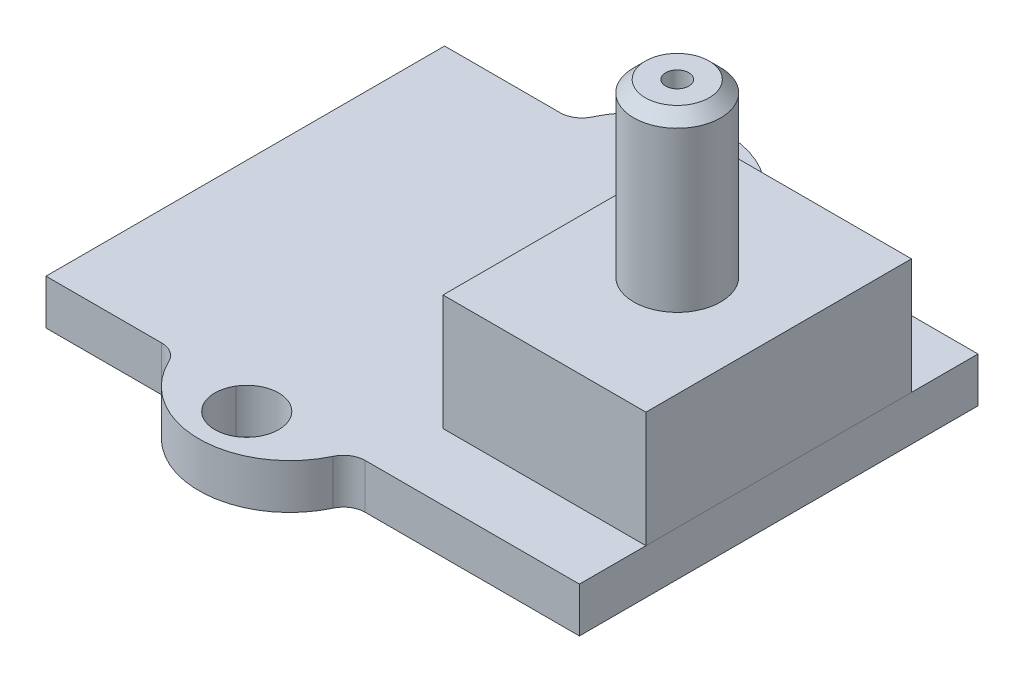
ISO-10303-21;
HEADER;
FILE_DESCRIPTION(('STEP AP214'),'2;1');
FILE_NAME('part.step','',(''),(''),'','','');
FILE_SCHEMA(('AUTOMOTIVE_DESIGN { 1 0 10303 214 1 1 1 1 }'));
ENDSEC;
DATA;
#1=APPLICATION_CONTEXT('core data for automotive mechanical design processes');
#2=APPLICATION_PROTOCOL_DEFINITION('international standard','automotive_design',2000,#1);
#3=PRODUCT_CONTEXT('',#1,'mechanical');
#4=PRODUCT('Part','Part','',(#3));
#5=PRODUCT_RELATED_PRODUCT_CATEGORY('part','',(#4));
#6=PRODUCT_DEFINITION_FORMATION('','',#4);
#7=PRODUCT_DEFINITION_CONTEXT('part definition',#1,'design');
#8=PRODUCT_DEFINITION('design','',#6,#7);
#9=PRODUCT_DEFINITION_SHAPE('','',#8);
#10=(LENGTH_UNIT() NAMED_UNIT(*) SI_UNIT(.MILLI.,.METRE.));
#11=(NAMED_UNIT(*) PLANE_ANGLE_UNIT() SI_UNIT($,.RADIAN.));
#12=(NAMED_UNIT(*) SI_UNIT($,.STERADIAN.) SOLID_ANGLE_UNIT());
#13=UNCERTAINTY_MEASURE_WITH_UNIT(LENGTH_MEASURE(1.E-05),#10,'distance_accuracy_value','');
#14=(GEOMETRIC_REPRESENTATION_CONTEXT(3) GLOBAL_UNCERTAINTY_ASSIGNED_CONTEXT((#13)) GLOBAL_UNIT_ASSIGNED_CONTEXT((#10,
#11,#12)) REPRESENTATION_CONTEXT('',''));
#15=CARTESIAN_POINT('',(0.,0.,0.));
#16=DIRECTION('',(0.,0.,1.));
#17=DIRECTION('',(1.,0.,0.));
#18=AXIS2_PLACEMENT_3D('',#15,#16,#17);
#19=CARTESIAN_POINT('',(0.,5.54,4.58));
#20=DIRECTION('',(0.,0.,1.));
#21=DIRECTION('',(1.,0.,0.));
#22=AXIS2_PLACEMENT_3D('',#19,#20,#21);
#23=PLANE('',#22);
#24=DIRECTION('',(-1.,0.,0.));
#25=VECTOR('',#24,1.);
#26=CARTESIAN_POINT('',(0.,1.55,4.58));
#27=LINE('',#26,#25);
#28=CARTESIAN_POINT('',(9.2,1.55,4.58));
#29=VERTEX_POINT('',#28);
#30=CARTESIAN_POINT('',(2.2,1.55,4.58));
#31=VERTEX_POINT('',#30);
#32=EDGE_CURVE('E154',#29,#31,#27,.T.);
#33=ORIENTED_EDGE('',*,*,#32,.F.);
#34=DIRECTION('',(0.,-1.,0.));
#35=VECTOR('',#34,1.);
#36=CARTESIAN_POINT('',(9.2,5.54,4.58));
#37=LINE('',#36,#35);
#38=CARTESIAN_POINT('',(9.2,5.54,4.58));
#39=VERTEX_POINT('',#38);
#40=EDGE_CURVE('E102',#39,#29,#37,.T.);
#41=ORIENTED_EDGE('',*,*,#40,.F.);
#42=DIRECTION('',(-1.,0.,0.));
#43=VECTOR('',#42,1.);
#44=CARTESIAN_POINT('',(0.,5.54,4.58));
#45=LINE('',#44,#43);
#46=CARTESIAN_POINT('',(2.2,5.54,4.58));
#47=VERTEX_POINT('',#46);
#48=EDGE_CURVE('E147',#39,#47,#45,.T.);
#49=ORIENTED_EDGE('',*,*,#48,.T.);
#50=DIRECTION('',(0.,-1.,0.));
#51=VECTOR('',#50,1.);
#52=CARTESIAN_POINT('',(2.2,5.54,4.58));
#53=LINE('',#52,#51);
#54=EDGE_CURVE('E144',#47,#31,#53,.T.);
#55=ORIENTED_EDGE('',*,*,#54,.T.);
#56=EDGE_LOOP('',(#33,#41,#49,#55));
#57=FACE_BOUND('',#56,.T.);
#58=ADVANCED_FACE('F84',(#57),#23,.T.);
#59=CARTESIAN_POINT('',(9.2,5.54,0.));
#60=DIRECTION('',(1.,0.,0.));
#61=DIRECTION('',(0.,0.,-1.));
#62=AXIS2_PLACEMENT_3D('',#59,#60,#61);
#63=PLANE('',#62);
#64=DIRECTION('',(0.,0.,1.));
#65=VECTOR('',#64,1.);
#66=CARTESIAN_POINT('',(9.2,1.55,0.));
#67=LINE('',#66,#65);
#68=CARTESIAN_POINT('',(9.2,1.55,-4.58));
#69=VERTEX_POINT('',#68);
#70=EDGE_CURVE('E149',#69,#29,#67,.T.);
#71=ORIENTED_EDGE('',*,*,#70,.F.);
#72=DIRECTION('',(0.,-1.,0.));
#73=VECTOR('',#72,1.);
#74=CARTESIAN_POINT('',(9.2,5.54,-4.58));
#75=LINE('',#74,#73);
#76=CARTESIAN_POINT('',(9.2,5.54,-4.58));
#77=VERTEX_POINT('',#76);
#78=EDGE_CURVE('E118',#77,#69,#75,.T.);
#79=ORIENTED_EDGE('',*,*,#78,.F.);
#80=DIRECTION('',(0.,0.,1.));
#81=VECTOR('',#80,1.);
#82=CARTESIAN_POINT('',(9.2,5.54,0.));
#83=LINE('',#82,#81);
#84=EDGE_CURVE('E135',#77,#39,#83,.T.);
#85=ORIENTED_EDGE('',*,*,#84,.T.);
#86=ORIENTED_EDGE('',*,*,#40,.T.);
#87=EDGE_LOOP('',(#71,#79,#85,#86));
#88=FACE_BOUND('',#87,.T.);
#89=ADVANCED_FACE('F197',(#88),#63,.T.);
#90=CARTESIAN_POINT('',(0.,5.54,-4.58));
#91=DIRECTION('',(0.,0.,1.));
#92=DIRECTION('',(1.,0.,0.));
#93=AXIS2_PLACEMENT_3D('',#90,#91,#92);
#94=PLANE('',#93);
#95=DIRECTION('',(-1.,0.,0.));
#96=VECTOR('',#95,1.);
#97=CARTESIAN_POINT('',(0.,1.55,-4.58));
#98=LINE('',#97,#96);
#99=CARTESIAN_POINT('',(2.2,1.55,-4.58));
#100=VERTEX_POINT('',#99);
#101=EDGE_CURVE('E140',#69,#100,#98,.T.);
#102=ORIENTED_EDGE('',*,*,#101,.T.);
#103=DIRECTION('',(0.,-1.,0.));
#104=VECTOR('',#103,1.);
#105=CARTESIAN_POINT('',(2.2,5.54,-4.58));
#106=LINE('',#105,#104);
#107=CARTESIAN_POINT('',(2.2,5.54,-4.58));
#108=VERTEX_POINT('',#107);
#109=EDGE_CURVE('E138',#108,#100,#106,.T.);
#110=ORIENTED_EDGE('',*,*,#109,.F.);
#111=DIRECTION('',(-1.,0.,0.));
#112=VECTOR('',#111,1.);
#113=CARTESIAN_POINT('',(0.,5.54,-4.58));
#114=LINE('',#113,#112);
#115=EDGE_CURVE('E132',#77,#108,#114,.T.);
#116=ORIENTED_EDGE('',*,*,#115,.F.);
#117=ORIENTED_EDGE('',*,*,#78,.T.);
#118=EDGE_LOOP('',(#102,#110,#116,#117));
#119=FACE_BOUND('',#118,.T.);
#120=ADVANCED_FACE('F139',(#119),#94,.F.);
#121=CARTESIAN_POINT('',(2.2,5.54,0.));
#122=DIRECTION('',(1.,0.,0.));
#123=DIRECTION('',(0.,0.,-1.));
#124=AXIS2_PLACEMENT_3D('',#121,#122,#123);
#125=PLANE('',#124);
#126=DIRECTION('',(0.,0.,1.));
#127=VECTOR('',#126,1.);
#128=CARTESIAN_POINT('',(2.2,1.55,0.));
#129=LINE('',#128,#127);
#130=EDGE_CURVE('E157',#100,#31,#129,.T.);
#131=ORIENTED_EDGE('',*,*,#130,.T.);
#132=ORIENTED_EDGE('',*,*,#54,.F.);
#133=DIRECTION('',(0.,0.,1.));
#134=VECTOR('',#133,1.);
#135=CARTESIAN_POINT('',(2.2,5.54,0.));
#136=LINE('',#135,#134);
#137=EDGE_CURVE('E129',#108,#47,#136,.T.);
#138=ORIENTED_EDGE('',*,*,#137,.F.);
#139=ORIENTED_EDGE('',*,*,#109,.T.);
#140=EDGE_LOOP('',(#131,#132,#138,#139));
#141=FACE_BOUND('',#140,.T.);
#142=ADVANCED_FACE('F146',(#141),#125,.F.);
#143=CARTESIAN_POINT('',(0.,5.54,0.));
#144=DIRECTION('',(0.,1.,0.));
#145=DIRECTION('',(0.,0.,1.));
#146=AXIS2_PLACEMENT_3D('',#143,#144,#145);
#147=PLANE('',#146);
#148=CARTESIAN_POINT('',(5.7,5.54,0.));
#149=DIRECTION('',(0.,1.,0.));
#150=DIRECTION('',(0.,0.,1.));
#151=AXIS2_PLACEMENT_3D('',#148,#149,#150);
#152=CIRCLE('',#151,1.5);
#153=CARTESIAN_POINT('',(5.7,5.54,1.5));
#154=VERTEX_POINT('',#153);
#155=EDGE_CURVE('E164',#154,#154,#152,.T.);
#156=ORIENTED_EDGE('',*,*,#155,.F.);
#157=EDGE_LOOP('',(#156));
#158=FACE_BOUND('',#157,.T.);
#159=ORIENTED_EDGE('',*,*,#48,.F.);
#160=ORIENTED_EDGE('',*,*,#84,.F.);
#161=ORIENTED_EDGE('',*,*,#115,.T.);
#162=ORIENTED_EDGE('',*,*,#137,.T.);
#163=EDGE_LOOP('',(#159,#160,#161,#162));
#164=FACE_BOUND('',#163,.T.);
#165=ADVANCED_FACE('F134',(#158,#164),#147,.T.);
#166=CARTESIAN_POINT('',(0.,1.55,0.));
#167=DIRECTION('',(0.,1.,0.));
#168=DIRECTION('',(0.,0.,1.));
#169=AXIS2_PLACEMENT_3D('',#166,#167,#168);
#170=PLANE('',#169);
#171=ORIENTED_EDGE('',*,*,#32,.T.);
#172=ORIENTED_EDGE('',*,*,#130,.F.);
#173=ORIENTED_EDGE('',*,*,#101,.F.);
#174=ORIENTED_EDGE('',*,*,#70,.T.);
#175=EDGE_LOOP('',(#171,#172,#173,#174));
#176=FACE_BOUND('',#175,.T.);
#177=ADVANCED_FACE('F185',(#176),#170,.F.);
#178=CARTESIAN_POINT('',(5.7,11.44,0.));
#179=DIRECTION('',(0.,1.,0.));
#180=DIRECTION('',(0.,0.,1.));
#181=AXIS2_PLACEMENT_3D('',#178,#179,#180);
#182=PLANE('',#181);
#183=CARTESIAN_POINT('',(5.7,11.44,0.));
#184=DIRECTION('',(0.,1.,0.));
#185=DIRECTION('',(0.,0.,1.));
#186=AXIS2_PLACEMENT_3D('',#183,#184,#185);
#187=CIRCLE('',#186,1.1);
#188=CARTESIAN_POINT('',(5.7,11.44,1.1));
#189=VERTEX_POINT('',#188);
#190=EDGE_CURVE('E94',#189,#189,#187,.T.);
#191=ORIENTED_EDGE('',*,*,#190,.T.);
#192=EDGE_LOOP('',(#191));
#193=FACE_BOUND('',#192,.T.);
#194=CARTESIAN_POINT('',(5.7,11.44,0.));
#195=DIRECTION('',(0.,1.,0.));
#196=DIRECTION('',(0.,0.,1.));
#197=AXIS2_PLACEMENT_3D('',#194,#195,#196);
#198=CIRCLE('',#197,0.4);
#199=CARTESIAN_POINT('',(5.7,11.44,0.4));
#200=VERTEX_POINT('',#199);
#201=EDGE_CURVE('E158',#200,#200,#198,.T.);
#202=ORIENTED_EDGE('',*,*,#201,.F.);
#203=EDGE_LOOP('',(#202));
#204=FACE_BOUND('',#203,.T.);
#205=ADVANCED_FACE('F182',(#193,#204),#182,.T.);
#206=CARTESIAN_POINT('',(5.7,11.44,0.));
#207=DIRECTION('',(0.,-1.,0.));
#208=DIRECTION('',(0.,0.,-1.));
#209=AXIS2_PLACEMENT_3D('',#206,#207,#208);
#210=CYLINDRICAL_SURFACE('',#209,1.5);
#211=CARTESIAN_POINT('',(5.7,11.04,0.));
#212=DIRECTION('',(0.,1.,0.));
#213=DIRECTION('',(0.,0.,1.));
#214=AXIS2_PLACEMENT_3D('',#211,#212,#213);
#215=CIRCLE('',#214,1.5);
#216=CARTESIAN_POINT('',(5.7,11.04,1.5));
#217=VERTEX_POINT('',#216);
#218=EDGE_CURVE('E13',#217,#217,#215,.F.);
#219=ORIENTED_EDGE('',*,*,#218,.T.);
#220=EDGE_LOOP('',(#219));
#221=FACE_BOUND('',#220,.T.);
#222=ORIENTED_EDGE('',*,*,#155,.T.);
#223=EDGE_LOOP('',(#222));
#224=FACE_BOUND('',#223,.T.);
#225=ADVANCED_FACE('F184',(#221,#224),#210,.T.);
#226=CARTESIAN_POINT('',(5.7,11.44,0.));
#227=DIRECTION('',(0.,-1.,0.));
#228=DIRECTION('',(0.,0.,-1.));
#229=AXIS2_PLACEMENT_3D('',#226,#227,#228);
#230=CYLINDRICAL_SURFACE('',#229,0.4);
#231=ORIENTED_EDGE('',*,*,#201,.T.);
#232=EDGE_LOOP('',(#231));
#233=FACE_BOUND('',#232,.T.);
#234=CARTESIAN_POINT('',(5.7,5.54,0.));
#235=DIRECTION('',(0.,1.,0.));
#236=DIRECTION('',(0.,0.,1.));
#237=AXIS2_PLACEMENT_3D('',#234,#235,#236);
#238=CIRCLE('',#237,0.4);
#239=CARTESIAN_POINT('',(5.7,5.54,0.4));
#240=VERTEX_POINT('',#239);
#241=EDGE_CURVE('E173',#240,#240,#238,.T.);
#242=ORIENTED_EDGE('',*,*,#241,.F.);
#243=EDGE_LOOP('',(#242));
#244=FACE_BOUND('',#243,.T.);
#245=ADVANCED_FACE('F179',(#233,#244),#230,.F.);
#246=ORIENTED_EDGE('',*,*,#241,.T.);
#247=EDGE_LOOP('',(#246));
#248=FACE_BOUND('',#247,.T.);
#249=ADVANCED_FACE('F209',(#248),#147,.T.);
#250=CARTESIAN_POINT('',(5.7,11.44,0.));
#251=DIRECTION('',(0.,-1.,0.));
#252=DIRECTION('',(0.,0.,-1.));
#253=AXIS2_PLACEMENT_3D('',#250,#251,#252);
#254=CONICAL_SURFACE('',#253,1.1,0.785398163397444);
#255=ORIENTED_EDGE('',*,*,#218,.F.);
#256=EDGE_LOOP('',(#255));
#257=FACE_BOUND('',#256,.T.);
#258=ORIENTED_EDGE('',*,*,#190,.F.);
#259=EDGE_LOOP('',(#258));
#260=FACE_BOUND('',#259,.T.);
#261=ADVANCED_FACE('F87',(#257,#260),#254,.T.);
#262=CLOSED_SHELL('',(#58,#89,#120,#142,#165,#177,#205,#225,#245,#249,#261));
#263=MANIFOLD_SOLID_BREP('B2',#262);
#264=CARTESIAN_POINT('',(0.,1.55,0.));
#265=DIRECTION('',(0.,1.,0.));
#266=DIRECTION('',(0.,0.,1.));
#267=AXIS2_PLACEMENT_3D('',#264,#265,#266);
#268=PLANE('',#267);
#269=DIRECTION('',(1.,0.,0.));
#270=VECTOR('',#269,1.);
#271=CARTESIAN_POINT('',(0.,1.55,6.875));
#272=LINE('',#271,#270);
#273=CARTESIAN_POINT('',(-9.2,1.55,6.875));
#274=VERTEX_POINT('',#273);
#275=CARTESIAN_POINT('',(-5.2124777579367,1.55,6.875));
#276=VERTEX_POINT('',#275);
#277=EDGE_CURVE('E405',#274,#276,#272,.T.);
#278=ORIENTED_EDGE('',*,*,#277,.T.);
#279=CARTESIAN_POINT('',(-5.2124777579367,1.55,7.625));
#280=DIRECTION('',(0.,1.,0.));
#281=DIRECTION('',(0.,0.,1.));
#282=AXIS2_PLACEMENT_3D('',#279,#280,#281);
#283=CIRCLE('',#282,0.75);
#284=CARTESIAN_POINT('',(-4.53438834586259,1.55,7.30453978525722));
#285=VERTEX_POINT('',#284);
#286=EDGE_CURVE('E479',#276,#285,#283,.F.);
#287=ORIENTED_EDGE('',*,*,#286,.T.);
#288=CARTESIAN_POINT('',(-1.7,1.55,5.96502808988764));
#289=DIRECTION('',(0.,1.,0.));
#290=DIRECTION('',(0.,0.,1.));
#291=AXIS2_PLACEMENT_3D('',#288,#289,#290);
#292=CIRCLE('',#291,3.13497191011236);
#293=CARTESIAN_POINT('',(1.13438834586259,1.55,7.30453978525722));
#294=VERTEX_POINT('',#293);
#295=EDGE_CURVE('E438',#285,#294,#292,.T.);
#296=ORIENTED_EDGE('',*,*,#295,.T.);
#297=CARTESIAN_POINT('',(1.8124777579367,1.55,7.625));
#298=DIRECTION('',(0.,1.,0.));
#299=DIRECTION('',(0.,0.,1.));
#300=AXIS2_PLACEMENT_3D('',#297,#298,#299);
#301=CIRCLE('',#300,0.75);
#302=CARTESIAN_POINT('',(1.8124777579367,1.55,6.875));
#303=VERTEX_POINT('',#302);
#304=EDGE_CURVE('E82',#294,#303,#301,.F.);
#305=ORIENTED_EDGE('',*,*,#304,.T.);
#306=CARTESIAN_POINT('',(9.2,1.55,6.875));
#307=VERTEX_POINT('',#306);
#308=EDGE_CURVE('E413',#303,#307,#272,.T.);
#309=ORIENTED_EDGE('',*,*,#308,.T.);
#310=DIRECTION('',(0.,0.,-1.));
#311=VECTOR('',#310,1.);
#312=CARTESIAN_POINT('',(9.2,1.55,0.));
#313=LINE('',#312,#311);
#314=CARTESIAN_POINT('',(9.2,1.55,-6.875));
#315=VERTEX_POINT('',#314);
#316=EDGE_CURVE('E495',#307,#315,#313,.T.);
#317=ORIENTED_EDGE('',*,*,#316,.T.);
#318=DIRECTION('',(1.,0.,0.));
#319=VECTOR('',#318,1.);
#320=CARTESIAN_POINT('',(0.,1.55,-6.875));
#321=LINE('',#320,#319);
#322=CARTESIAN_POINT('',(1.81247775793669,1.55,-6.875));
#323=VERTEX_POINT('',#322);
#324=EDGE_CURVE('E496',#323,#315,#321,.T.);
#325=ORIENTED_EDGE('',*,*,#324,.F.);
#326=CARTESIAN_POINT('',(1.81247775793669,1.55,-7.625));
#327=DIRECTION('',(0.,1.,0.));
#328=DIRECTION('',(0.,0.,1.));
#329=AXIS2_PLACEMENT_3D('',#326,#327,#328);
#330=CIRCLE('',#329,0.75);
#331=CARTESIAN_POINT('',(1.13438834586259,1.55,-7.30453978525722));
#332=VERTEX_POINT('',#331);
#333=EDGE_CURVE('E475',#323,#332,#330,.F.);
#334=ORIENTED_EDGE('',*,*,#333,.T.);
#335=CARTESIAN_POINT('',(-1.7,1.55,-5.96502808988764));
#336=DIRECTION('',(0.,1.,0.));
#337=DIRECTION('',(0.,0.,1.));
#338=AXIS2_PLACEMENT_3D('',#335,#336,#337);
#339=CIRCLE('',#338,3.13497191011236);
#340=CARTESIAN_POINT('',(-4.53438834586259,1.55,-7.30453978525722));
#341=VERTEX_POINT('',#340);
#342=EDGE_CURVE('E500',#341,#332,#339,.F.);
#343=ORIENTED_EDGE('',*,*,#342,.F.);
#344=CARTESIAN_POINT('',(-5.2124777579367,1.55,-7.625));
#345=DIRECTION('',(0.,1.,0.));
#346=DIRECTION('',(0.,0.,1.));
#347=AXIS2_PLACEMENT_3D('',#344,#345,#346);
#348=CIRCLE('',#347,0.75);
#349=CARTESIAN_POINT('',(-5.2124777579367,1.55,-6.875));
#350=VERTEX_POINT('',#349);
#351=EDGE_CURVE('E471',#341,#350,#348,.F.);
#352=ORIENTED_EDGE('',*,*,#351,.T.);
#353=CARTESIAN_POINT('',(-9.2,1.55,-6.875));
#354=VERTEX_POINT('',#353);
#355=EDGE_CURVE('E501',#354,#350,#321,.T.);
#356=ORIENTED_EDGE('',*,*,#355,.F.);
#357=DIRECTION('',(0.,0.,-1.));
#358=VECTOR('',#357,1.);
#359=CARTESIAN_POINT('',(-9.2,1.55,0.));
#360=LINE('',#359,#358);
#361=EDGE_CURVE('E411',#274,#354,#360,.T.);
#362=ORIENTED_EDGE('',*,*,#361,.F.);
#363=EDGE_LOOP('',(#278,#287,#296,#305,#309,#317,#325,#334,#343,#352,#356,#362));
#364=FACE_BOUND('',#363,.T.);
#365=CARTESIAN_POINT('',(-1.7,1.55,-7.45));
#366=DIRECTION('',(0.,1.,0.));
#367=DIRECTION('',(0.,0.,1.));
#368=AXIS2_PLACEMENT_3D('',#365,#366,#367);
#369=CIRCLE('',#368,1.1);
#370=CARTESIAN_POINT('',(-1.7,1.55,-6.35));
#371=VERTEX_POINT('',#370);
#372=EDGE_CURVE('E404',#371,#371,#369,.T.);
#373=ORIENTED_EDGE('',*,*,#372,.F.);
#374=EDGE_LOOP('',(#373));
#375=FACE_BOUND('',#374,.T.);
#376=CARTESIAN_POINT('',(-1.7,1.55,7.45));
#377=DIRECTION('',(0.,1.,0.));
#378=DIRECTION('',(0.,0.,1.));
#379=AXIS2_PLACEMENT_3D('',#376,#377,#378);
#380=CIRCLE('',#379,1.1);
#381=CARTESIAN_POINT('',(-0.762250033324448,1.55,6.875));
#382=VERTEX_POINT('',#381);
#383=CARTESIAN_POINT('',(-2.63774996667555,1.55,6.875));
#384=VERTEX_POINT('',#383);
#385=EDGE_CURVE('E399',#382,#384,#380,.T.);
#386=ORIENTED_EDGE('',*,*,#385,.F.);
#387=CARTESIAN_POINT('',(-1.7,1.55,7.45));
#388=DIRECTION('',(0.,1.,0.));
#389=DIRECTION('',(0.,0.,1.));
#390=AXIS2_PLACEMENT_3D('',#387,#388,#389);
#391=CIRCLE('',#390,1.1);
#392=EDGE_CURVE('E384',#384,#382,#391,.T.);
#393=ORIENTED_EDGE('',*,*,#392,.F.);
#394=EDGE_LOOP('',(#386,#393));
#395=FACE_BOUND('',#394,.T.);
#396=ADVANCED_FACE('F285',(#364,#375,#395),#268,.T.);
#397=CARTESIAN_POINT('',(0.,0.,0.));
#398=DIRECTION('',(0.,1.,0.));
#399=DIRECTION('',(0.,0.,1.));
#400=AXIS2_PLACEMENT_3D('',#397,#398,#399);
#401=PLANE('',#400);
#402=CARTESIAN_POINT('',(-1.7,0.,-7.45));
#403=DIRECTION('',(0.,1.,0.));
#404=DIRECTION('',(0.,0.,1.));
#405=AXIS2_PLACEMENT_3D('',#402,#403,#404);
#406=CIRCLE('',#405,1.1);
#407=CARTESIAN_POINT('',(-1.7,0.,-6.35));
#408=VERTEX_POINT('',#407);
#409=EDGE_CURVE('E435',#408,#408,#406,.T.);
#410=ORIENTED_EDGE('',*,*,#409,.T.);
#411=EDGE_LOOP('',(#410));
#412=FACE_BOUND('',#411,.T.);
#413=CARTESIAN_POINT('',(-1.7,0.,5.96502808988764));
#414=DIRECTION('',(0.,1.,0.));
#415=DIRECTION('',(0.,0.,1.));
#416=AXIS2_PLACEMENT_3D('',#413,#414,#415);
#417=CIRCLE('',#416,3.13497191011236);
#418=CARTESIAN_POINT('',(-4.53438834586259,0.,7.30453978525722));
#419=VERTEX_POINT('',#418);
#420=CARTESIAN_POINT('',(1.13438834586259,0.,7.30453978525722));
#421=VERTEX_POINT('',#420);
#422=EDGE_CURVE('E394',#419,#421,#417,.T.);
#423=ORIENTED_EDGE('',*,*,#422,.F.);
#424=CARTESIAN_POINT('',(-5.2124777579367,0.,7.625));
#425=DIRECTION('',(0.,1.,0.));
#426=DIRECTION('',(0.,0.,1.));
#427=AXIS2_PLACEMENT_3D('',#424,#425,#426);
#428=CIRCLE('',#427,0.75);
#429=CARTESIAN_POINT('',(-5.2124777579367,0.,6.875));
#430=VERTEX_POINT('',#429);
#431=EDGE_CURVE('E477',#419,#430,#428,.T.);
#432=ORIENTED_EDGE('',*,*,#431,.T.);
#433=DIRECTION('',(1.,0.,0.));
#434=VECTOR('',#433,1.);
#435=CARTESIAN_POINT('',(0.,0.,6.875));
#436=LINE('',#435,#434);
#437=CARTESIAN_POINT('',(-9.2,0.,6.875));
#438=VERTEX_POINT('',#437);
#439=EDGE_CURVE('E422',#438,#430,#436,.T.);
#440=ORIENTED_EDGE('',*,*,#439,.F.);
#441=DIRECTION('',(0.,0.,-1.));
#442=VECTOR('',#441,1.);
#443=CARTESIAN_POINT('',(-9.2,0.,0.));
#444=LINE('',#443,#442);
#445=CARTESIAN_POINT('',(-9.2,0.,-6.875));
#446=VERTEX_POINT('',#445);
#447=EDGE_CURVE('E431',#438,#446,#444,.T.);
#448=ORIENTED_EDGE('',*,*,#447,.T.);
#449=DIRECTION('',(1.,0.,0.));
#450=VECTOR('',#449,1.);
#451=CARTESIAN_POINT('',(0.,0.,-6.875));
#452=LINE('',#451,#450);
#453=CARTESIAN_POINT('',(-5.2124777579367,0.,-6.875));
#454=VERTEX_POINT('',#453);
#455=EDGE_CURVE('E428',#446,#454,#452,.T.);
#456=ORIENTED_EDGE('',*,*,#455,.T.);
#457=CARTESIAN_POINT('',(-5.2124777579367,0.,-7.625));
#458=DIRECTION('',(0.,1.,0.));
#459=DIRECTION('',(0.,0.,1.));
#460=AXIS2_PLACEMENT_3D('',#457,#458,#459);
#461=CIRCLE('',#460,0.75);
#462=CARTESIAN_POINT('',(-4.53438834586259,0.,-7.30453978525722));
#463=VERTEX_POINT('',#462);
#464=EDGE_CURVE('E469',#454,#463,#461,.T.);
#465=ORIENTED_EDGE('',*,*,#464,.T.);
#466=CARTESIAN_POINT('',(-1.7,0.,-5.96502808988764));
#467=DIRECTION('',(0.,1.,0.));
#468=DIRECTION('',(0.,0.,1.));
#469=AXIS2_PLACEMENT_3D('',#466,#467,#468);
#470=CIRCLE('',#469,3.13497191011236);
#471=CARTESIAN_POINT('',(1.13438834586259,0.,-7.30453978525722));
#472=VERTEX_POINT('',#471);
#473=EDGE_CURVE('E427',#463,#472,#470,.F.);
#474=ORIENTED_EDGE('',*,*,#473,.T.);
#475=CARTESIAN_POINT('',(1.81247775793669,0.,-7.625));
#476=DIRECTION('',(0.,1.,0.));
#477=DIRECTION('',(0.,0.,1.));
#478=AXIS2_PLACEMENT_3D('',#475,#476,#477);
#479=CIRCLE('',#478,0.75);
#480=CARTESIAN_POINT('',(1.81247775793669,0.,-6.875));
#481=VERTEX_POINT('',#480);
#482=EDGE_CURVE('E473',#472,#481,#479,.T.);
#483=ORIENTED_EDGE('',*,*,#482,.T.);
#484=CARTESIAN_POINT('',(9.2,0.,-6.875));
#485=VERTEX_POINT('',#484);
#486=EDGE_CURVE('E425',#481,#485,#452,.T.);
#487=ORIENTED_EDGE('',*,*,#486,.T.);
#488=DIRECTION('',(0.,0.,-1.));
#489=VECTOR('',#488,1.);
#490=CARTESIAN_POINT('',(9.2,0.,0.));
#491=LINE('',#490,#489);
#492=CARTESIAN_POINT('',(9.2,0.,6.875));
#493=VERTEX_POINT('',#492);
#494=EDGE_CURVE('E421',#493,#485,#491,.T.);
#495=ORIENTED_EDGE('',*,*,#494,.F.);
#496=CARTESIAN_POINT('',(1.8124777579367,0.,6.875));
#497=VERTEX_POINT('',#496);
#498=EDGE_CURVE('E419',#497,#493,#436,.T.);
#499=ORIENTED_EDGE('',*,*,#498,.F.);
#500=CARTESIAN_POINT('',(1.8124777579367,0.,7.625));
#501=DIRECTION('',(0.,1.,0.));
#502=DIRECTION('',(0.,0.,1.));
#503=AXIS2_PLACEMENT_3D('',#500,#501,#502);
#504=CIRCLE('',#503,0.75);
#505=EDGE_CURVE('E293',#497,#421,#504,.T.);
#506=ORIENTED_EDGE('',*,*,#505,.T.);
#507=EDGE_LOOP('',(#423,#432,#440,#448,#456,#465,#474,#483,#487,#495,#499,#506));
#508=FACE_BOUND('',#507,.T.);
#509=CARTESIAN_POINT('',(-1.7,0.,7.45));
#510=DIRECTION('',(0.,1.,0.));
#511=DIRECTION('',(0.,0.,1.));
#512=AXIS2_PLACEMENT_3D('',#509,#510,#511);
#513=CIRCLE('',#512,1.1);
#514=CARTESIAN_POINT('',(-0.762250033324448,0.,6.875));
#515=VERTEX_POINT('',#514);
#516=CARTESIAN_POINT('',(-2.63774996667555,0.,6.875));
#517=VERTEX_POINT('',#516);
#518=EDGE_CURVE('E402',#515,#517,#513,.F.);
#519=ORIENTED_EDGE('',*,*,#518,.F.);
#520=CARTESIAN_POINT('',(-1.7,0.,7.45));
#521=DIRECTION('',(0.,1.,0.));
#522=DIRECTION('',(0.,0.,1.));
#523=AXIS2_PLACEMENT_3D('',#520,#521,#522);
#524=CIRCLE('',#523,1.1);
#525=EDGE_CURVE('E401',#515,#517,#524,.T.);
#526=ORIENTED_EDGE('',*,*,#525,.T.);
#527=EDGE_LOOP('',(#519,#526));
#528=FACE_BOUND('',#527,.T.);
#529=ADVANCED_FACE('F483',(#412,#508,#528),#401,.F.);
#530=CARTESIAN_POINT('',(-1.7,1.55,7.45));
#531=DIRECTION('',(0.,-1.,0.));
#532=DIRECTION('',(0.,0.,-1.));
#533=AXIS2_PLACEMENT_3D('',#530,#531,#532);
#534=CYLINDRICAL_SURFACE('',#533,1.1);
#535=ORIENTED_EDGE('',*,*,#525,.F.);
#536=DIRECTION('',(0.,-1.,0.));
#537=VECTOR('',#536,1.);
#538=CARTESIAN_POINT('',(-0.762250033324448,1.55,6.875));
#539=LINE('',#538,#537);
#540=EDGE_CURVE('E387',#382,#515,#539,.T.);
#541=ORIENTED_EDGE('',*,*,#540,.F.);
#542=ORIENTED_EDGE('',*,*,#385,.T.);
#543=DIRECTION('',(0.,-1.,0.));
#544=VECTOR('',#543,1.);
#545=CARTESIAN_POINT('',(-2.63774996667555,1.55,6.875));
#546=LINE('',#545,#544);
#547=EDGE_CURVE('E390',#384,#517,#546,.T.);
#548=ORIENTED_EDGE('',*,*,#547,.T.);
#549=EDGE_LOOP('',(#535,#541,#542,#548));
#550=FACE_BOUND('',#549,.T.);
#551=ADVANCED_FACE('F398',(#550),#534,.F.);
#552=CARTESIAN_POINT('',(-1.7,1.55,5.96502808988764));
#553=DIRECTION('',(0.,-1.,0.));
#554=DIRECTION('',(0.,0.,-1.));
#555=AXIS2_PLACEMENT_3D('',#552,#553,#554);
#556=CYLINDRICAL_SURFACE('',#555,3.13497191011236);
#557=ORIENTED_EDGE('',*,*,#295,.F.);
#558=DIRECTION('',(0.,-1.,0.));
#559=VECTOR('',#558,1.);
#560=CARTESIAN_POINT('',(-4.53438834586259,1.55,7.30453978525722));
#561=LINE('',#560,#559);
#562=EDGE_CURVE('E462',#285,#419,#561,.T.);
#563=ORIENTED_EDGE('',*,*,#562,.T.);
#564=ORIENTED_EDGE('',*,*,#422,.T.);
#565=DIRECTION('',(0.,-1.,0.));
#566=VECTOR('',#565,1.);
#567=CARTESIAN_POINT('',(1.13438834586259,1.55,7.30453978525722));
#568=LINE('',#567,#566);
#569=EDGE_CURVE('E460',#421,#294,#568,.F.);
#570=ORIENTED_EDGE('',*,*,#569,.T.);
#571=EDGE_LOOP('',(#557,#563,#564,#570));
#572=FACE_BOUND('',#571,.T.);
#573=ADVANCED_FACE('F488',(#572),#556,.T.);
#574=CARTESIAN_POINT('',(0.,1.55,6.875));
#575=DIRECTION('',(0.,0.,-1.));
#576=DIRECTION('',(-1.,0.,0.));
#577=AXIS2_PLACEMENT_3D('',#574,#575,#576);
#578=PLANE('',#577);
#579=ORIENTED_EDGE('',*,*,#308,.F.);
#580=DIRECTION('',(0.,1.,0.));
#581=VECTOR('',#580,1.);
#582=CARTESIAN_POINT('',(1.8124777579367,0.,6.875));
#583=LINE('',#582,#581);
#584=EDGE_CURVE('E467',#303,#497,#583,.F.);
#585=ORIENTED_EDGE('',*,*,#584,.T.);
#586=ORIENTED_EDGE('',*,*,#498,.T.);
#587=DIRECTION('',(0.,-1.,0.));
#588=VECTOR('',#587,1.);
#589=CARTESIAN_POINT('',(9.2,1.55,6.875));
#590=LINE('',#589,#588);
#591=EDGE_CURVE('E439',#307,#493,#590,.T.);
#592=ORIENTED_EDGE('',*,*,#591,.F.);
#593=EDGE_LOOP('',(#579,#585,#586,#592));
#594=FACE_BOUND('',#593,.T.);
#595=ADVANCED_FACE('F491',(#594),#578,.F.);
#596=CARTESIAN_POINT('',(9.2,1.55,0.));
#597=DIRECTION('',(-1.,0.,0.));
#598=DIRECTION('',(0.,0.,1.));
#599=AXIS2_PLACEMENT_3D('',#596,#597,#598);
#600=PLANE('',#599);
#601=ORIENTED_EDGE('',*,*,#494,.T.);
#602=DIRECTION('',(0.,-1.,0.));
#603=VECTOR('',#602,1.);
#604=CARTESIAN_POINT('',(9.2,1.55,-6.875));
#605=LINE('',#604,#603);
#606=EDGE_CURVE('E444',#315,#485,#605,.T.);
#607=ORIENTED_EDGE('',*,*,#606,.F.);
#608=ORIENTED_EDGE('',*,*,#316,.F.);
#609=ORIENTED_EDGE('',*,*,#591,.T.);
#610=EDGE_LOOP('',(#601,#607,#608,#609));
#611=FACE_BOUND('',#610,.T.);
#612=ADVANCED_FACE('F566',(#611),#600,.F.);
#613=CARTESIAN_POINT('',(0.,1.55,-6.875));
#614=DIRECTION('',(0.,0.,-1.));
#615=DIRECTION('',(-1.,0.,0.));
#616=AXIS2_PLACEMENT_3D('',#613,#614,#615);
#617=PLANE('',#616);
#618=ORIENTED_EDGE('',*,*,#486,.F.);
#619=DIRECTION('',(0.,1.,0.));
#620=VECTOR('',#619,1.);
#621=CARTESIAN_POINT('',(1.81247775793669,1.55,-6.875));
#622=LINE('',#621,#620);
#623=EDGE_CURVE('E458',#481,#323,#622,.T.);
#624=ORIENTED_EDGE('',*,*,#623,.T.);
#625=ORIENTED_EDGE('',*,*,#324,.T.);
#626=ORIENTED_EDGE('',*,*,#606,.T.);
#627=EDGE_LOOP('',(#618,#624,#625,#626));
#628=FACE_BOUND('',#627,.T.);
#629=ADVANCED_FACE('F563',(#628),#617,.T.);
#630=CARTESIAN_POINT('',(-1.7,1.55,-5.96502808988764));
#631=DIRECTION('',(0.,-1.,0.));
#632=DIRECTION('',(0.,0.,-1.));
#633=AXIS2_PLACEMENT_3D('',#630,#631,#632);
#634=CYLINDRICAL_SURFACE('',#633,3.13497191011236);
#635=ORIENTED_EDGE('',*,*,#473,.F.);
#636=DIRECTION('',(0.,-1.,0.));
#637=VECTOR('',#636,1.);
#638=CARTESIAN_POINT('',(-4.53438834586259,1.55,-7.30453978525722));
#639=LINE('',#638,#637);
#640=EDGE_CURVE('E456',#463,#341,#639,.F.);
#641=ORIENTED_EDGE('',*,*,#640,.T.);
#642=ORIENTED_EDGE('',*,*,#342,.T.);
#643=DIRECTION('',(0.,-1.,0.));
#644=VECTOR('',#643,1.);
#645=CARTESIAN_POINT('',(1.13438834586259,1.55,-7.30453978525722));
#646=LINE('',#645,#644);
#647=EDGE_CURVE('E453',#332,#472,#646,.T.);
#648=ORIENTED_EDGE('',*,*,#647,.T.);
#649=EDGE_LOOP('',(#635,#641,#642,#648));
#650=FACE_BOUND('',#649,.T.);
#651=ADVANCED_FACE('F562',(#650),#634,.T.);
#652=ORIENTED_EDGE('',*,*,#355,.T.);
#653=DIRECTION('',(0.,1.,0.));
#654=VECTOR('',#653,1.);
#655=CARTESIAN_POINT('',(-5.2124777579367,0.,-6.875));
#656=LINE('',#655,#654);
#657=EDGE_CURVE('E450',#350,#454,#656,.F.);
#658=ORIENTED_EDGE('',*,*,#657,.T.);
#659=ORIENTED_EDGE('',*,*,#455,.F.);
#660=DIRECTION('',(0.,-1.,0.));
#661=VECTOR('',#660,1.);
#662=CARTESIAN_POINT('',(-9.2,1.55,-6.875));
#663=LINE('',#662,#661);
#664=EDGE_CURVE('E442',#354,#446,#663,.T.);
#665=ORIENTED_EDGE('',*,*,#664,.F.);
#666=EDGE_LOOP('',(#652,#658,#659,#665));
#667=FACE_BOUND('',#666,.T.);
#668=ADVANCED_FACE('F524',(#667),#617,.T.);
#669=CARTESIAN_POINT('',(-9.2,1.55,0.));
#670=DIRECTION('',(-1.,0.,0.));
#671=DIRECTION('',(0.,0.,1.));
#672=AXIS2_PLACEMENT_3D('',#669,#670,#671);
#673=PLANE('',#672);
#674=ORIENTED_EDGE('',*,*,#447,.F.);
#675=DIRECTION('',(0.,-1.,0.));
#676=VECTOR('',#675,1.);
#677=CARTESIAN_POINT('',(-9.2,1.55,6.875));
#678=LINE('',#677,#676);
#679=EDGE_CURVE('E408',#274,#438,#678,.T.);
#680=ORIENTED_EDGE('',*,*,#679,.F.);
#681=ORIENTED_EDGE('',*,*,#361,.T.);
#682=ORIENTED_EDGE('',*,*,#664,.T.);
#683=EDGE_LOOP('',(#674,#680,#681,#682));
#684=FACE_BOUND('',#683,.T.);
#685=ADVANCED_FACE('F514',(#684),#673,.T.);
#686=ORIENTED_EDGE('',*,*,#439,.T.);
#687=DIRECTION('',(0.,1.,0.));
#688=VECTOR('',#687,1.);
#689=CARTESIAN_POINT('',(-5.2124777579367,1.55,6.875));
#690=LINE('',#689,#688);
#691=EDGE_CURVE('E465',#430,#276,#690,.T.);
#692=ORIENTED_EDGE('',*,*,#691,.T.);
#693=ORIENTED_EDGE('',*,*,#277,.F.);
#694=ORIENTED_EDGE('',*,*,#679,.T.);
#695=EDGE_LOOP('',(#686,#692,#693,#694));
#696=FACE_BOUND('',#695,.T.);
#697=ADVANCED_FACE('F530',(#696),#578,.F.);
#698=CARTESIAN_POINT('',(-1.7,1.55,-7.45));
#699=DIRECTION('',(0.,-1.,0.));
#700=DIRECTION('',(0.,0.,-1.));
#701=AXIS2_PLACEMENT_3D('',#698,#699,#700);
#702=CYLINDRICAL_SURFACE('',#701,1.1);
#703=ORIENTED_EDGE('',*,*,#372,.T.);
#704=EDGE_LOOP('',(#703));
#705=FACE_BOUND('',#704,.T.);
#706=ORIENTED_EDGE('',*,*,#409,.F.);
#707=EDGE_LOOP('',(#706));
#708=FACE_BOUND('',#707,.T.);
#709=ADVANCED_FACE('F550',(#705,#708),#702,.F.);
#710=CARTESIAN_POINT('',(-1.7,1.55,7.45));
#711=DIRECTION('',(0.,-1.,0.));
#712=DIRECTION('',(0.,0.,-1.));
#713=AXIS2_PLACEMENT_3D('',#710,#711,#712);
#714=CYLINDRICAL_SURFACE('',#713,1.1);
#715=ORIENTED_EDGE('',*,*,#518,.T.);
#716=ORIENTED_EDGE('',*,*,#547,.F.);
#717=ORIENTED_EDGE('',*,*,#392,.T.);
#718=ORIENTED_EDGE('',*,*,#540,.T.);
#719=EDGE_LOOP('',(#715,#716,#717,#718));
#720=FACE_BOUND('',#719,.T.);
#721=ADVANCED_FACE('F386',(#720),#714,.F.);
#722=CARTESIAN_POINT('',(-5.2124777579367,1.55,-7.625));
#723=DIRECTION('',(0.,-1.,0.));
#724=DIRECTION('',(0.,0.,-1.));
#725=AXIS2_PLACEMENT_3D('',#722,#723,#724);
#726=CYLINDRICAL_SURFACE('',#725,0.75);
#727=ORIENTED_EDGE('',*,*,#351,.F.);
#728=ORIENTED_EDGE('',*,*,#640,.F.);
#729=ORIENTED_EDGE('',*,*,#464,.F.);
#730=ORIENTED_EDGE('',*,*,#657,.F.);
#731=EDGE_LOOP('',(#727,#728,#729,#730));
#732=FACE_BOUND('',#731,.T.);
#733=ADVANCED_FACE('F522',(#732),#726,.F.);
#734=CARTESIAN_POINT('',(1.81247775793669,1.55,-7.625));
#735=DIRECTION('',(0.,-1.,0.));
#736=DIRECTION('',(0.,0.,-1.));
#737=AXIS2_PLACEMENT_3D('',#734,#735,#736);
#738=CYLINDRICAL_SURFACE('',#737,0.75);
#739=ORIENTED_EDGE('',*,*,#333,.F.);
#740=ORIENTED_EDGE('',*,*,#623,.F.);
#741=ORIENTED_EDGE('',*,*,#482,.F.);
#742=ORIENTED_EDGE('',*,*,#647,.F.);
#743=EDGE_LOOP('',(#739,#740,#741,#742));
#744=FACE_BOUND('',#743,.T.);
#745=ADVANCED_FACE('F534',(#744),#738,.F.);
#746=CARTESIAN_POINT('',(-5.2124777579367,1.55,7.625));
#747=DIRECTION('',(0.,-1.,0.));
#748=DIRECTION('',(0.,0.,-1.));
#749=AXIS2_PLACEMENT_3D('',#746,#747,#748);
#750=CYLINDRICAL_SURFACE('',#749,0.75);
#751=ORIENTED_EDGE('',*,*,#286,.F.);
#752=ORIENTED_EDGE('',*,*,#691,.F.);
#753=ORIENTED_EDGE('',*,*,#431,.F.);
#754=ORIENTED_EDGE('',*,*,#562,.F.);
#755=EDGE_LOOP('',(#751,#752,#753,#754));
#756=FACE_BOUND('',#755,.T.);
#757=ADVANCED_FACE('F532',(#756),#750,.F.);
#758=CARTESIAN_POINT('',(1.8124777579367,1.55,7.625));
#759=DIRECTION('',(0.,-1.,0.));
#760=DIRECTION('',(0.,0.,-1.));
#761=AXIS2_PLACEMENT_3D('',#758,#759,#760);
#762=CYLINDRICAL_SURFACE('',#761,0.75);
#763=ORIENTED_EDGE('',*,*,#304,.F.);
#764=ORIENTED_EDGE('',*,*,#569,.F.);
#765=ORIENTED_EDGE('',*,*,#505,.F.);
#766=ORIENTED_EDGE('',*,*,#584,.F.);
#767=EDGE_LOOP('',(#763,#764,#765,#766));
#768=FACE_BOUND('',#767,.T.);
#769=ADVANCED_FACE('F287',(#768),#762,.F.);
#770=CLOSED_SHELL('',(#396,#529,#551,#573,#595,#612,#629,#651,#668,#685,#697,#709,#721,#733,
#745,#757,#769));
#771=MANIFOLD_SOLID_BREP('B7',#770);
#772=ADVANCED_BREP_SHAPE_REPRESENTATION('',(#18,#263,#771),#14);
#773=SHAPE_DEFINITION_REPRESENTATION(#9,#772);
ENDSEC;
END-ISO-10303-21;
